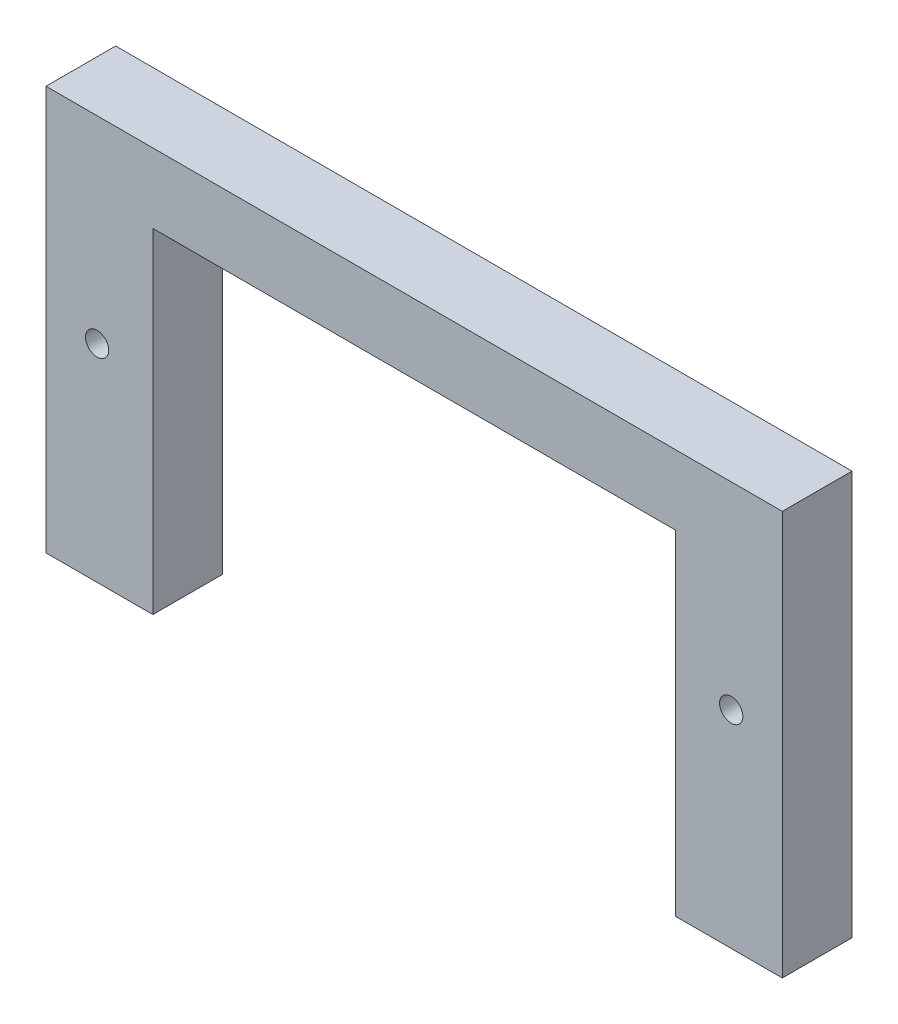
ISO-10303-21;
HEADER;
FILE_DESCRIPTION(('STEP AP214'),'2;1');
FILE_NAME('part.step','',(''),(''),'','','');
FILE_SCHEMA(('AUTOMOTIVE_DESIGN { 1 0 10303 214 1 1 1 1 }'));
ENDSEC;
DATA;
#1=APPLICATION_CONTEXT('core data for automotive mechanical design processes');
#2=APPLICATION_PROTOCOL_DEFINITION('international standard','automotive_design',2000,#1);
#3=PRODUCT_CONTEXT('',#1,'mechanical');
#4=PRODUCT('Part','Part','',(#3));
#5=PRODUCT_RELATED_PRODUCT_CATEGORY('part','',(#4));
#6=PRODUCT_DEFINITION_FORMATION('','',#4);
#7=PRODUCT_DEFINITION_CONTEXT('part definition',#1,'design');
#8=PRODUCT_DEFINITION('design','',#6,#7);
#9=PRODUCT_DEFINITION_SHAPE('','',#8);
#10=(LENGTH_UNIT() NAMED_UNIT(*) SI_UNIT(.MILLI.,.METRE.));
#11=(NAMED_UNIT(*) PLANE_ANGLE_UNIT() SI_UNIT($,.RADIAN.));
#12=(NAMED_UNIT(*) SI_UNIT($,.STERADIAN.) SOLID_ANGLE_UNIT());
#13=UNCERTAINTY_MEASURE_WITH_UNIT(LENGTH_MEASURE(1.E-05),#10,'distance_accuracy_value','');
#14=(GEOMETRIC_REPRESENTATION_CONTEXT(3) GLOBAL_UNCERTAINTY_ASSIGNED_CONTEXT((#13)) GLOBAL_UNIT_ASSIGNED_CONTEXT((#10,
#11,#12)) REPRESENTATION_CONTEXT('',''));
#15=CARTESIAN_POINT('',(0.,0.,0.));
#16=DIRECTION('',(0.,0.,1.));
#17=DIRECTION('',(1.,0.,0.));
#18=AXIS2_PLACEMENT_3D('',#15,#16,#17);
#19=CARTESIAN_POINT('',(0.,0.,3.));
#20=DIRECTION('',(0.,0.,1.));
#21=DIRECTION('',(1.,0.,0.));
#22=AXIS2_PLACEMENT_3D('',#19,#20,#21);
#23=PLANE('',#22);
#24=CARTESIAN_POINT('',(29.5,8.9,3.));
#25=DIRECTION('',(0.,0.,1.));
#26=DIRECTION('',(1.,0.,0.));
#27=AXIS2_PLACEMENT_3D('',#24,#25,#26);
#28=CIRCLE('',#27,0.499999999999999);
#29=CARTESIAN_POINT('',(30.,8.9,3.));
#30=VERTEX_POINT('',#29);
#31=EDGE_CURVE('E143',#30,#30,#28,.T.);
#32=ORIENTED_EDGE('',*,*,#31,.F.);
#33=EDGE_LOOP('',(#32));
#34=FACE_BOUND('',#33,.T.);
#35=DIRECTION('',(0.,-1.,0.));
#36=VECTOR('',#35,1.);
#37=CARTESIAN_POINT('',(0.,17.4,3.));
#38=LINE('',#37,#36);
#39=CARTESIAN_POINT('',(0.,17.4,3.));
#40=VERTEX_POINT('',#39);
#41=CARTESIAN_POINT('',(0.,0.,3.));
#42=VERTEX_POINT('',#41);
#43=EDGE_CURVE('E154',#40,#42,#38,.T.);
#44=ORIENTED_EDGE('',*,*,#43,.T.);
#45=DIRECTION('',(1.,0.,0.));
#46=VECTOR('',#45,1.);
#47=CARTESIAN_POINT('',(0.,0.,3.));
#48=LINE('',#47,#46);
#49=CARTESIAN_POINT('',(4.6,0.,3.));
#50=VERTEX_POINT('',#49);
#51=EDGE_CURVE('E102',#42,#50,#48,.T.);
#52=ORIENTED_EDGE('',*,*,#51,.T.);
#53=DIRECTION('',(0.,1.,0.));
#54=VECTOR('',#53,1.);
#55=CARTESIAN_POINT('',(4.6,0.,3.));
#56=LINE('',#55,#54);
#57=CARTESIAN_POINT('',(4.6,14.4,3.));
#58=VERTEX_POINT('',#57);
#59=EDGE_CURVE('E169',#50,#58,#56,.T.);
#60=ORIENTED_EDGE('',*,*,#59,.T.);
#61=DIRECTION('',(1.,0.,0.));
#62=VECTOR('',#61,1.);
#63=CARTESIAN_POINT('',(4.6,14.4,3.));
#64=LINE('',#63,#62);
#65=CARTESIAN_POINT('',(27.1,14.4,3.));
#66=VERTEX_POINT('',#65);
#67=EDGE_CURVE('E182',#58,#66,#64,.T.);
#68=ORIENTED_EDGE('',*,*,#67,.T.);
#69=DIRECTION('',(0.,-1.,0.));
#70=VECTOR('',#69,1.);
#71=CARTESIAN_POINT('',(27.1,14.4,3.));
#72=LINE('',#71,#70);
#73=CARTESIAN_POINT('',(27.1,0.,3.));
#74=VERTEX_POINT('',#73);
#75=EDGE_CURVE('E121',#66,#74,#72,.T.);
#76=ORIENTED_EDGE('',*,*,#75,.T.);
#77=DIRECTION('',(1.,0.,0.));
#78=VECTOR('',#77,1.);
#79=CARTESIAN_POINT('',(27.1,0.,3.));
#80=LINE('',#79,#78);
#81=CARTESIAN_POINT('',(31.7,0.,3.));
#82=VERTEX_POINT('',#81);
#83=EDGE_CURVE('E115',#74,#82,#80,.T.);
#84=ORIENTED_EDGE('',*,*,#83,.T.);
#85=DIRECTION('',(0.,1.,0.));
#86=VECTOR('',#85,1.);
#87=CARTESIAN_POINT('',(31.7,0.,3.));
#88=LINE('',#87,#86);
#89=CARTESIAN_POINT('',(31.7,17.4,3.));
#90=VERTEX_POINT('',#89);
#91=EDGE_CURVE('E119',#82,#90,#88,.T.);
#92=ORIENTED_EDGE('',*,*,#91,.T.);
#93=DIRECTION('',(-1.,0.,0.));
#94=VECTOR('',#93,1.);
#95=CARTESIAN_POINT('',(31.7,17.4,3.));
#96=LINE('',#95,#94);
#97=EDGE_CURVE('E59',#90,#40,#96,.T.);
#98=ORIENTED_EDGE('',*,*,#97,.T.);
#99=EDGE_LOOP('',(#44,#52,#60,#68,#76,#84,#92,#98));
#100=FACE_BOUND('',#99,.T.);
#101=CARTESIAN_POINT('',(2.20000000000004,8.9,3.));
#102=DIRECTION('',(0.,0.,1.));
#103=DIRECTION('',(1.,0.,0.));
#104=AXIS2_PLACEMENT_3D('',#101,#102,#103);
#105=CIRCLE('',#104,0.5);
#106=CARTESIAN_POINT('',(2.70000000000004,8.9,3.));
#107=VERTEX_POINT('',#106);
#108=EDGE_CURVE('E191',#107,#107,#105,.T.);
#109=ORIENTED_EDGE('',*,*,#108,.F.);
#110=EDGE_LOOP('',(#109));
#111=FACE_BOUND('',#110,.T.);
#112=ADVANCED_FACE('F42',(#34,#100,#111),#23,.T.);
#113=CARTESIAN_POINT('',(0.,0.,0.));
#114=DIRECTION('',(0.,0.,1.));
#115=DIRECTION('',(1.,0.,0.));
#116=AXIS2_PLACEMENT_3D('',#113,#114,#115);
#117=PLANE('',#116);
#118=DIRECTION('',(0.,-1.,0.));
#119=VECTOR('',#118,1.);
#120=CARTESIAN_POINT('',(0.,17.4,0.));
#121=LINE('',#120,#119);
#122=CARTESIAN_POINT('',(0.,17.4,0.));
#123=VERTEX_POINT('',#122);
#124=CARTESIAN_POINT('',(0.,0.,0.));
#125=VERTEX_POINT('',#124);
#126=EDGE_CURVE('E139',#123,#125,#121,.T.);
#127=ORIENTED_EDGE('',*,*,#126,.F.);
#128=DIRECTION('',(-1.,0.,0.));
#129=VECTOR('',#128,1.);
#130=CARTESIAN_POINT('',(31.7,17.4,0.));
#131=LINE('',#130,#129);
#132=CARTESIAN_POINT('',(31.7,17.4,0.));
#133=VERTEX_POINT('',#132);
#134=EDGE_CURVE('E94',#133,#123,#131,.T.);
#135=ORIENTED_EDGE('',*,*,#134,.F.);
#136=DIRECTION('',(0.,1.,0.));
#137=VECTOR('',#136,1.);
#138=CARTESIAN_POINT('',(31.7,0.,0.));
#139=LINE('',#138,#137);
#140=CARTESIAN_POINT('',(31.7,0.,0.));
#141=VERTEX_POINT('',#140);
#142=EDGE_CURVE('E88',#141,#133,#139,.T.);
#143=ORIENTED_EDGE('',*,*,#142,.F.);
#144=DIRECTION('',(1.,0.,0.));
#145=VECTOR('',#144,1.);
#146=CARTESIAN_POINT('',(27.1,0.,0.));
#147=LINE('',#146,#145);
#148=CARTESIAN_POINT('',(27.1,0.,0.));
#149=VERTEX_POINT('',#148);
#150=EDGE_CURVE('E129',#149,#141,#147,.T.);
#151=ORIENTED_EDGE('',*,*,#150,.F.);
#152=DIRECTION('',(0.,-1.,0.));
#153=VECTOR('',#152,1.);
#154=CARTESIAN_POINT('',(27.1,14.4,0.));
#155=LINE('',#154,#153);
#156=CARTESIAN_POINT('',(27.1,14.4,0.));
#157=VERTEX_POINT('',#156);
#158=EDGE_CURVE('E149',#157,#149,#155,.T.);
#159=ORIENTED_EDGE('',*,*,#158,.F.);
#160=DIRECTION('',(1.,0.,0.));
#161=VECTOR('',#160,1.);
#162=CARTESIAN_POINT('',(4.6,14.4,0.));
#163=LINE('',#162,#161);
#164=CARTESIAN_POINT('',(4.6,14.4,0.));
#165=VERTEX_POINT('',#164);
#166=EDGE_CURVE('E147',#165,#157,#163,.T.);
#167=ORIENTED_EDGE('',*,*,#166,.F.);
#168=DIRECTION('',(0.,1.,0.));
#169=VECTOR('',#168,1.);
#170=CARTESIAN_POINT('',(4.6,0.,0.));
#171=LINE('',#170,#169);
#172=CARTESIAN_POINT('',(4.6,0.,0.));
#173=VERTEX_POINT('',#172);
#174=EDGE_CURVE('E145',#173,#165,#171,.T.);
#175=ORIENTED_EDGE('',*,*,#174,.F.);
#176=DIRECTION('',(1.,0.,0.));
#177=VECTOR('',#176,1.);
#178=CARTESIAN_POINT('',(0.,0.,0.));
#179=LINE('',#178,#177);
#180=EDGE_CURVE('E142',#125,#173,#179,.T.);
#181=ORIENTED_EDGE('',*,*,#180,.F.);
#182=EDGE_LOOP('',(#127,#135,#143,#151,#159,#167,#175,#181));
#183=FACE_BOUND('',#182,.T.);
#184=CARTESIAN_POINT('',(29.5,8.9,0.));
#185=DIRECTION('',(0.,0.,1.));
#186=DIRECTION('',(1.,0.,0.));
#187=AXIS2_PLACEMENT_3D('',#184,#185,#186);
#188=CIRCLE('',#187,0.499999999999999);
#189=CARTESIAN_POINT('',(30.,8.9,0.));
#190=VERTEX_POINT('',#189);
#191=EDGE_CURVE('E188',#190,#190,#188,.T.);
#192=ORIENTED_EDGE('',*,*,#191,.T.);
#193=EDGE_LOOP('',(#192));
#194=FACE_BOUND('',#193,.T.);
#195=CARTESIAN_POINT('',(2.20000000000004,8.9,0.));
#196=DIRECTION('',(0.,0.,1.));
#197=DIRECTION('',(1.,0.,0.));
#198=AXIS2_PLACEMENT_3D('',#195,#196,#197);
#199=CIRCLE('',#198,0.5);
#200=CARTESIAN_POINT('',(2.70000000000004,8.9,0.));
#201=VERTEX_POINT('',#200);
#202=EDGE_CURVE('E194',#201,#201,#199,.T.);
#203=ORIENTED_EDGE('',*,*,#202,.T.);
#204=EDGE_LOOP('',(#203));
#205=FACE_BOUND('',#204,.T.);
#206=ADVANCED_FACE('F173',(#183,#194,#205),#117,.F.);
#207=CARTESIAN_POINT('',(0.,17.4,3.));
#208=DIRECTION('',(1.,0.,0.));
#209=DIRECTION('',(0.,1.,0.));
#210=AXIS2_PLACEMENT_3D('',#207,#208,#209);
#211=PLANE('',#210);
#212=ORIENTED_EDGE('',*,*,#126,.T.);
#213=DIRECTION('',(0.,0.,-1.));
#214=VECTOR('',#213,1.);
#215=CARTESIAN_POINT('',(0.,0.,3.));
#216=LINE('',#215,#214);
#217=EDGE_CURVE('E13',#42,#125,#216,.T.);
#218=ORIENTED_EDGE('',*,*,#217,.F.);
#219=ORIENTED_EDGE('',*,*,#43,.F.);
#220=DIRECTION('',(0.,0.,-1.));
#221=VECTOR('',#220,1.);
#222=CARTESIAN_POINT('',(0.,17.4,3.));
#223=LINE('',#222,#221);
#224=EDGE_CURVE('E135',#40,#123,#223,.T.);
#225=ORIENTED_EDGE('',*,*,#224,.T.);
#226=EDGE_LOOP('',(#212,#218,#219,#225));
#227=FACE_BOUND('',#226,.T.);
#228=ADVANCED_FACE('F44',(#227),#211,.F.);
#229=CARTESIAN_POINT('',(0.,0.,3.));
#230=DIRECTION('',(0.,1.,0.));
#231=DIRECTION('',(0.,0.,1.));
#232=AXIS2_PLACEMENT_3D('',#229,#230,#231);
#233=PLANE('',#232);
#234=ORIENTED_EDGE('',*,*,#180,.T.);
#235=DIRECTION('',(0.,0.,-1.));
#236=VECTOR('',#235,1.);
#237=CARTESIAN_POINT('',(4.6,0.,3.));
#238=LINE('',#237,#236);
#239=EDGE_CURVE('E51',#50,#173,#238,.T.);
#240=ORIENTED_EDGE('',*,*,#239,.F.);
#241=ORIENTED_EDGE('',*,*,#51,.F.);
#242=ORIENTED_EDGE('',*,*,#217,.T.);
#243=EDGE_LOOP('',(#234,#240,#241,#242));
#244=FACE_BOUND('',#243,.T.);
#245=ADVANCED_FACE('F226',(#244),#233,.F.);
#246=CARTESIAN_POINT('',(4.6,0.,3.));
#247=DIRECTION('',(-1.,0.,0.));
#248=DIRECTION('',(0.,0.,1.));
#249=AXIS2_PLACEMENT_3D('',#246,#247,#248);
#250=PLANE('',#249);
#251=ORIENTED_EDGE('',*,*,#174,.T.);
#252=DIRECTION('',(0.,0.,-1.));
#253=VECTOR('',#252,1.);
#254=CARTESIAN_POINT('',(4.6,14.4,3.));
#255=LINE('',#254,#253);
#256=EDGE_CURVE('E161',#58,#165,#255,.T.);
#257=ORIENTED_EDGE('',*,*,#256,.F.);
#258=ORIENTED_EDGE('',*,*,#59,.F.);
#259=ORIENTED_EDGE('',*,*,#239,.T.);
#260=EDGE_LOOP('',(#251,#257,#258,#259));
#261=FACE_BOUND('',#260,.T.);
#262=ADVANCED_FACE('F167',(#261),#250,.F.);
#263=CARTESIAN_POINT('',(4.6,14.4,3.));
#264=DIRECTION('',(0.,1.,0.));
#265=DIRECTION('',(0.,0.,1.));
#266=AXIS2_PLACEMENT_3D('',#263,#264,#265);
#267=PLANE('',#266);
#268=ORIENTED_EDGE('',*,*,#166,.T.);
#269=DIRECTION('',(0.,0.,-1.));
#270=VECTOR('',#269,1.);
#271=CARTESIAN_POINT('',(27.1,14.4,3.));
#272=LINE('',#271,#270);
#273=EDGE_CURVE('E158',#66,#157,#272,.T.);
#274=ORIENTED_EDGE('',*,*,#273,.F.);
#275=ORIENTED_EDGE('',*,*,#67,.F.);
#276=ORIENTED_EDGE('',*,*,#256,.T.);
#277=EDGE_LOOP('',(#268,#274,#275,#276));
#278=FACE_BOUND('',#277,.T.);
#279=ADVANCED_FACE('F178',(#278),#267,.F.);
#280=CARTESIAN_POINT('',(27.1,14.4,3.));
#281=DIRECTION('',(1.,0.,0.));
#282=DIRECTION('',(0.,0.,-1.));
#283=AXIS2_PLACEMENT_3D('',#280,#281,#282);
#284=PLANE('',#283);
#285=ORIENTED_EDGE('',*,*,#158,.T.);
#286=DIRECTION('',(0.,0.,-1.));
#287=VECTOR('',#286,1.);
#288=CARTESIAN_POINT('',(27.1,0.,3.));
#289=LINE('',#288,#287);
#290=EDGE_CURVE('E130',#74,#149,#289,.T.);
#291=ORIENTED_EDGE('',*,*,#290,.F.);
#292=ORIENTED_EDGE('',*,*,#75,.F.);
#293=ORIENTED_EDGE('',*,*,#273,.T.);
#294=EDGE_LOOP('',(#285,#291,#292,#293));
#295=FACE_BOUND('',#294,.T.);
#296=ADVANCED_FACE('F181',(#295),#284,.F.);
#297=CARTESIAN_POINT('',(27.1,0.,3.));
#298=DIRECTION('',(0.,1.,0.));
#299=DIRECTION('',(0.,0.,1.));
#300=AXIS2_PLACEMENT_3D('',#297,#298,#299);
#301=PLANE('',#300);
#302=ORIENTED_EDGE('',*,*,#150,.T.);
#303=DIRECTION('',(0.,0.,-1.));
#304=VECTOR('',#303,1.);
#305=CARTESIAN_POINT('',(31.7,0.,3.));
#306=LINE('',#305,#304);
#307=EDGE_CURVE('E126',#82,#141,#306,.T.);
#308=ORIENTED_EDGE('',*,*,#307,.F.);
#309=ORIENTED_EDGE('',*,*,#83,.F.);
#310=ORIENTED_EDGE('',*,*,#290,.T.);
#311=EDGE_LOOP('',(#302,#308,#309,#310));
#312=FACE_BOUND('',#311,.T.);
#313=ADVANCED_FACE('F127',(#312),#301,.F.);
#314=CARTESIAN_POINT('',(31.7,0.,3.));
#315=DIRECTION('',(-1.,0.,0.));
#316=DIRECTION('',(0.,0.,1.));
#317=AXIS2_PLACEMENT_3D('',#314,#315,#316);
#318=PLANE('',#317);
#319=ORIENTED_EDGE('',*,*,#142,.T.);
#320=DIRECTION('',(0.,0.,-1.));
#321=VECTOR('',#320,1.);
#322=CARTESIAN_POINT('',(31.7,17.4,3.));
#323=LINE('',#322,#321);
#324=EDGE_CURVE('E131',#90,#133,#323,.T.);
#325=ORIENTED_EDGE('',*,*,#324,.F.);
#326=ORIENTED_EDGE('',*,*,#91,.F.);
#327=ORIENTED_EDGE('',*,*,#307,.T.);
#328=EDGE_LOOP('',(#319,#325,#326,#327));
#329=FACE_BOUND('',#328,.T.);
#330=ADVANCED_FACE('F133',(#329),#318,.F.);
#331=CARTESIAN_POINT('',(31.7,17.4,3.));
#332=DIRECTION('',(0.,-1.,0.));
#333=DIRECTION('',(1.,0.,0.));
#334=AXIS2_PLACEMENT_3D('',#331,#332,#333);
#335=PLANE('',#334);
#336=ORIENTED_EDGE('',*,*,#134,.T.);
#337=ORIENTED_EDGE('',*,*,#224,.F.);
#338=ORIENTED_EDGE('',*,*,#97,.F.);
#339=ORIENTED_EDGE('',*,*,#324,.T.);
#340=EDGE_LOOP('',(#336,#337,#338,#339));
#341=FACE_BOUND('',#340,.T.);
#342=ADVANCED_FACE('F214',(#341),#335,.F.);
#343=CARTESIAN_POINT('',(29.5,8.9,3.));
#344=DIRECTION('',(0.,0.,-1.));
#345=DIRECTION('',(-1.,0.,0.));
#346=AXIS2_PLACEMENT_3D('',#343,#344,#345);
#347=CYLINDRICAL_SURFACE('',#346,0.499999999999999);
#348=ORIENTED_EDGE('',*,*,#31,.T.);
#349=EDGE_LOOP('',(#348));
#350=FACE_BOUND('',#349,.T.);
#351=ORIENTED_EDGE('',*,*,#191,.F.);
#352=EDGE_LOOP('',(#351));
#353=FACE_BOUND('',#352,.T.);
#354=ADVANCED_FACE('F211',(#350,#353),#347,.F.);
#355=CARTESIAN_POINT('',(2.20000000000004,8.9,3.));
#356=DIRECTION('',(0.,0.,-1.));
#357=DIRECTION('',(-1.,0.,0.));
#358=AXIS2_PLACEMENT_3D('',#355,#356,#357);
#359=CYLINDRICAL_SURFACE('',#358,0.5);
#360=ORIENTED_EDGE('',*,*,#108,.T.);
#361=EDGE_LOOP('',(#360));
#362=FACE_BOUND('',#361,.T.);
#363=ORIENTED_EDGE('',*,*,#202,.F.);
#364=EDGE_LOOP('',(#363));
#365=FACE_BOUND('',#364,.T.);
#366=ADVANCED_FACE('F200',(#362,#365),#359,.F.);
#367=CLOSED_SHELL('',(#112,#206,#228,#245,#262,#279,#296,#313,#330,#342,#354,#366));
#368=MANIFOLD_SOLID_BREP('B2',#367);
#369=ADVANCED_BREP_SHAPE_REPRESENTATION('',(#18,#368),#14);
#370=SHAPE_DEFINITION_REPRESENTATION(#9,#369);
ENDSEC;
END-ISO-10303-21;
